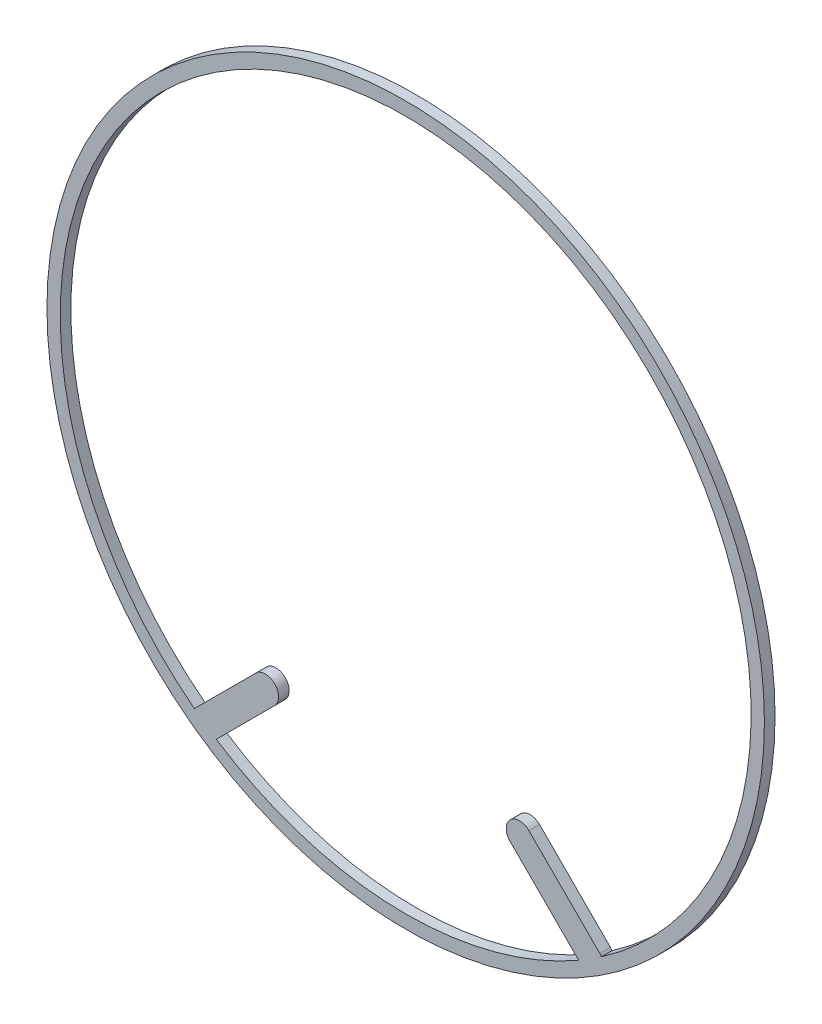
ISO-10303-21;
HEADER;
FILE_DESCRIPTION(('STEP AP214'),'2;1');
FILE_NAME('part.step','',(''),(''),'','','');
FILE_SCHEMA(('AUTOMOTIVE_DESIGN { 1 0 10303 214 1 1 1 1 }'));
ENDSEC;
DATA;
#1=APPLICATION_CONTEXT('core data for automotive mechanical design processes');
#2=APPLICATION_PROTOCOL_DEFINITION('international standard','automotive_design',2000,#1);
#3=PRODUCT_CONTEXT('',#1,'mechanical');
#4=PRODUCT('Part','Part','',(#3));
#5=PRODUCT_RELATED_PRODUCT_CATEGORY('part','',(#4));
#6=PRODUCT_DEFINITION_FORMATION('','',#4);
#7=PRODUCT_DEFINITION_CONTEXT('part definition',#1,'design');
#8=PRODUCT_DEFINITION('design','',#6,#7);
#9=PRODUCT_DEFINITION_SHAPE('','',#8);
#10=(LENGTH_UNIT() NAMED_UNIT(*) SI_UNIT(.MILLI.,.METRE.));
#11=(NAMED_UNIT(*) PLANE_ANGLE_UNIT() SI_UNIT($,.RADIAN.));
#12=(NAMED_UNIT(*) SI_UNIT($,.STERADIAN.) SOLID_ANGLE_UNIT());
#13=UNCERTAINTY_MEASURE_WITH_UNIT(LENGTH_MEASURE(1.E-05),#10,'distance_accuracy_value','');
#14=(GEOMETRIC_REPRESENTATION_CONTEXT(3) GLOBAL_UNCERTAINTY_ASSIGNED_CONTEXT((#13)) GLOBAL_UNIT_ASSIGNED_CONTEXT((#10,
#11,#12)) REPRESENTATION_CONTEXT('',''));
#15=CARTESIAN_POINT('',(0.,0.,0.));
#16=DIRECTION('',(0.,0.,1.));
#17=DIRECTION('',(1.,0.,0.));
#18=AXIS2_PLACEMENT_3D('',#15,#16,#17);
#19=CARTESIAN_POINT('',(0.,0.,2.54));
#20=DIRECTION('',(0.,0.,-1.));
#21=DIRECTION('',(-1.,0.,0.));
#22=AXIS2_PLACEMENT_3D('',#19,#20,#21);
#23=CYLINDRICAL_SURFACE('',#22,82.55);
#24=CARTESIAN_POINT('',(0.,0.,0.));
#25=DIRECTION('',(0.,0.,1.));
#26=DIRECTION('',(1.,0.,0.));
#27=AXIS2_PLACEMENT_3D('',#24,#25,#26);
#28=CIRCLE('',#27,82.55);
#29=CARTESIAN_POINT('',(46.7853456927431,-68.0120131183494,0.));
#30=VERTEX_POINT('',#29);
#31=CARTESIAN_POINT('',(-50.4766048244375,-65.319329952148,0.));
#32=VERTEX_POINT('',#31);
#33=EDGE_CURVE('E164',#30,#32,#28,.T.);
#34=ORIENTED_EDGE('',*,*,#33,.F.);
#35=DIRECTION('',(0.,0.,-1.));
#36=VECTOR('',#35,1.);
#37=CARTESIAN_POINT('',(46.7853456927431,-68.0120131183494,2.54));
#38=LINE('',#37,#36);
#39=CARTESIAN_POINT('',(46.7853456927431,-68.0120131183494,2.54));
#40=VERTEX_POINT('',#39);
#41=EDGE_CURVE('E11',#40,#30,#38,.T.);
#42=ORIENTED_EDGE('',*,*,#41,.F.);
#43=CARTESIAN_POINT('',(0.,0.,2.54));
#44=DIRECTION('',(0.,0.,1.));
#45=DIRECTION('',(1.,0.,0.));
#46=AXIS2_PLACEMENT_3D('',#43,#44,#45);
#47=CIRCLE('',#46,82.55);
#48=CARTESIAN_POINT('',(-50.4766048244375,-65.319329952148,2.54));
#49=VERTEX_POINT('',#48);
#50=EDGE_CURVE('E340',#40,#49,#47,.T.);
#51=ORIENTED_EDGE('',*,*,#50,.T.);
#52=DIRECTION('',(0.,0.,-1.));
#53=VECTOR('',#52,1.);
#54=CARTESIAN_POINT('',(-50.4766048244375,-65.319329952148,2.54));
#55=LINE('',#54,#53);
#56=EDGE_CURVE('E50',#49,#32,#55,.T.);
#57=ORIENTED_EDGE('',*,*,#56,.T.);
#58=EDGE_LOOP('',(#34,#42,#51,#57));
#59=FACE_BOUND('',#58,.T.);
#60=ADVANCED_FACE('F33',(#59),#23,.F.);
#61=CARTESIAN_POINT('',(44.1353782328995,-69.7608119809317,2.54));
#62=DIRECTION('',(0.,0.,-1.));
#63=DIRECTION('',(-1.,0.,0.));
#64=AXIS2_PLACEMENT_3D('',#61,#62,#63);
#65=CYLINDRICAL_SURFACE('',#64,3.175);
#66=CARTESIAN_POINT('',(44.1353782328995,-69.7608119809317,0.));
#67=DIRECTION('',(0.,0.,1.));
#68=DIRECTION('',(1.,0.,0.));
#69=AXIS2_PLACEMENT_3D('',#66,#67,#68);
#70=CIRCLE('',#69,3.175);
#71=CARTESIAN_POINT('',(46.3804422631666,-67.5157479506646,0.));
#72=VERTEX_POINT('',#71);
#73=EDGE_CURVE('E161',#72,#30,#70,.F.);
#74=ORIENTED_EDGE('',*,*,#73,.F.);
#75=DIRECTION('',(0.,0.,-1.));
#76=VECTOR('',#75,1.);
#77=CARTESIAN_POINT('',(46.3804422631666,-67.5157479506646,2.54));
#78=LINE('',#77,#76);
#79=CARTESIAN_POINT('',(46.3804422631666,-67.5157479506646,2.54));
#80=VERTEX_POINT('',#79);
#81=EDGE_CURVE('E42',#80,#72,#78,.T.);
#82=ORIENTED_EDGE('',*,*,#81,.F.);
#83=CARTESIAN_POINT('',(44.1353782328995,-69.7608119809317,2.54));
#84=DIRECTION('',(0.,0.,1.));
#85=DIRECTION('',(1.,0.,0.));
#86=AXIS2_PLACEMENT_3D('',#83,#84,#85);
#87=CIRCLE('',#86,3.175);
#88=EDGE_CURVE('E338',#80,#40,#87,.F.);
#89=ORIENTED_EDGE('',*,*,#88,.T.);
#90=ORIENTED_EDGE('',*,*,#41,.T.);
#91=EDGE_LOOP('',(#74,#82,#89,#90));
#92=FACE_BOUND('',#91,.T.);
#93=ADVANCED_FACE('F162',(#92),#65,.T.);
#94=CARTESIAN_POINT('',(83.8005578343696,-104.935863521868,2.54));
#95=DIRECTION('',(0.707106781186547,0.707106781186548,0.));
#96=DIRECTION('',(-0.707106781186548,0.707106781186547,0.));
#97=AXIS2_PLACEMENT_3D('',#94,#95,#96);
#98=PLANE('',#97);
#99=DIRECTION('',(0.707106781186548,-0.707106781186547,0.));
#100=VECTOR('',#99,1.);
#101=CARTESIAN_POINT('',(83.8005578343696,-104.935863521868,0.));
#102=LINE('',#101,#100);
#103=CARTESIAN_POINT('',(29.4516302822347,-50.5869359697327,0.));
#104=VERTEX_POINT('',#103);
#105=EDGE_CURVE('E154',#104,#72,#102,.T.);
#106=ORIENTED_EDGE('',*,*,#105,.F.);
#107=DIRECTION('',(0.,0.,-1.));
#108=VECTOR('',#107,1.);
#109=CARTESIAN_POINT('',(29.4516302822347,-50.5869359697327,2.54));
#110=LINE('',#109,#108);
#111=CARTESIAN_POINT('',(29.4516302822347,-50.5869359697327,2.54));
#112=VERTEX_POINT('',#111);
#113=EDGE_CURVE('E147',#112,#104,#110,.T.);
#114=ORIENTED_EDGE('',*,*,#113,.F.);
#115=DIRECTION('',(0.707106781186548,-0.707106781186547,0.));
#116=VECTOR('',#115,1.);
#117=CARTESIAN_POINT('',(83.8005578343696,-104.935863521868,2.54));
#118=LINE('',#117,#116);
#119=EDGE_CURVE('E156',#112,#80,#118,.T.);
#120=ORIENTED_EDGE('',*,*,#119,.T.);
#121=ORIENTED_EDGE('',*,*,#81,.T.);
#122=EDGE_LOOP('',(#106,#114,#120,#121));
#123=FACE_BOUND('',#122,.T.);
#124=ADVANCED_FACE('F152',(#123),#98,.T.);
#125=CARTESIAN_POINT('',(27.2065662519674,-52.832,2.54));
#126=DIRECTION('',(0.,0.,-1.));
#127=DIRECTION('',(-1.,0.,0.));
#128=AXIS2_PLACEMENT_3D('',#125,#126,#127);
#129=CYLINDRICAL_SURFACE('',#128,3.175);
#130=CARTESIAN_POINT('',(27.2065662519674,-52.832,0.));
#131=DIRECTION('',(0.,0.,1.));
#132=DIRECTION('',(1.,0.,0.));
#133=AXIS2_PLACEMENT_3D('',#130,#131,#132);
#134=CIRCLE('',#133,3.175);
#135=CARTESIAN_POINT('',(24.9615022217001,-55.0770640302673,0.));
#136=VERTEX_POINT('',#135);
#137=EDGE_CURVE('E169',#104,#136,#134,.T.);
#138=ORIENTED_EDGE('',*,*,#137,.T.);
#139=DIRECTION('',(0.,0.,-1.));
#140=VECTOR('',#139,1.);
#141=CARTESIAN_POINT('',(24.9615022217001,-55.0770640302673,2.54));
#142=LINE('',#141,#140);
#143=CARTESIAN_POINT('',(24.9615022217001,-55.0770640302673,2.54));
#144=VERTEX_POINT('',#143);
#145=EDGE_CURVE('E144',#144,#136,#142,.T.);
#146=ORIENTED_EDGE('',*,*,#145,.F.);
#147=CARTESIAN_POINT('',(27.2065662519674,-52.832,2.54));
#148=DIRECTION('',(0.,0.,1.));
#149=DIRECTION('',(1.,0.,0.));
#150=AXIS2_PLACEMENT_3D('',#147,#148,#149);
#151=CIRCLE('',#150,3.175);
#152=EDGE_CURVE('E336',#112,#144,#151,.T.);
#153=ORIENTED_EDGE('',*,*,#152,.F.);
#154=ORIENTED_EDGE('',*,*,#113,.T.);
#155=EDGE_LOOP('',(#138,#146,#153,#154));
#156=FACE_BOUND('',#155,.T.);
#157=ADVANCED_FACE('F213',(#156),#129,.T.);
#158=CARTESIAN_POINT('',(79.310429773835,-109.425991582402,2.54));
#159=DIRECTION('',(0.707106781186548,0.707106781186548,0.));
#160=DIRECTION('',(-0.707106781186548,0.707106781186548,0.));
#161=AXIS2_PLACEMENT_3D('',#158,#159,#160);
#162=PLANE('',#161);
#163=DIRECTION('',(0.707106781186548,-0.707106781186548,0.));
#164=VECTOR('',#163,1.);
#165=CARTESIAN_POINT('',(79.310429773835,-109.425991582402,0.));
#166=LINE('',#165,#164);
#167=CARTESIAN_POINT('',(41.3382693496002,-71.4538311581674,0.));
#168=VERTEX_POINT('',#167);
#169=EDGE_CURVE('E171',#136,#168,#166,.T.);
#170=ORIENTED_EDGE('',*,*,#169,.T.);
#171=DIRECTION('',(0.,0.,-1.));
#172=VECTOR('',#171,1.);
#173=CARTESIAN_POINT('',(41.3382693496002,-71.4538311581674,2.54));
#174=LINE('',#173,#172);
#175=CARTESIAN_POINT('',(41.3382693496002,-71.4538311581674,2.54));
#176=VERTEX_POINT('',#175);
#177=EDGE_CURVE('E142',#176,#168,#174,.T.);
#178=ORIENTED_EDGE('',*,*,#177,.F.);
#179=DIRECTION('',(0.707106781186548,-0.707106781186548,0.));
#180=VECTOR('',#179,1.);
#181=CARTESIAN_POINT('',(79.310429773835,-109.425991582402,2.54));
#182=LINE('',#181,#180);
#183=EDGE_CURVE('E333',#144,#176,#182,.T.);
#184=ORIENTED_EDGE('',*,*,#183,.F.);
#185=ORIENTED_EDGE('',*,*,#145,.T.);
#186=EDGE_LOOP('',(#170,#178,#184,#185));
#187=FACE_BOUND('',#186,.T.);
#188=ADVANCED_FACE('F216',(#187),#162,.F.);
#189=CARTESIAN_POINT('',(0.,0.,2.54));
#190=DIRECTION('',(0.,0.,-1.));
#191=DIRECTION('',(-1.,0.,0.));
#192=AXIS2_PLACEMENT_3D('',#189,#190,#191);
#193=CYLINDRICAL_SURFACE('',#192,82.55);
#194=CARTESIAN_POINT('',(0.,0.,0.));
#195=DIRECTION('',(0.,0.,1.));
#196=DIRECTION('',(1.,0.,0.));
#197=AXIS2_PLACEMENT_3D('',#194,#195,#196);
#198=CIRCLE('',#197,82.55);
#199=CARTESIAN_POINT('',(-45.2610474198302,-69.0357884467171,0.));
#200=VERTEX_POINT('',#199);
#201=EDGE_CURVE('E177',#200,#168,#198,.T.);
#202=ORIENTED_EDGE('',*,*,#201,.F.);
#203=DIRECTION('',(0.,0.,-1.));
#204=VECTOR('',#203,1.);
#205=CARTESIAN_POINT('',(-45.2610474198302,-69.0357884467171,2.54));
#206=LINE('',#205,#204);
#207=CARTESIAN_POINT('',(-45.2610474198302,-69.0357884467171,2.54));
#208=VERTEX_POINT('',#207);
#209=EDGE_CURVE('E136',#208,#200,#206,.T.);
#210=ORIENTED_EDGE('',*,*,#209,.F.);
#211=CARTESIAN_POINT('',(0.,0.,2.54));
#212=DIRECTION('',(0.,0.,1.));
#213=DIRECTION('',(1.,0.,0.));
#214=AXIS2_PLACEMENT_3D('',#211,#212,#213);
#215=CIRCLE('',#214,82.55);
#216=EDGE_CURVE('E331',#208,#176,#215,.T.);
#217=ORIENTED_EDGE('',*,*,#216,.T.);
#218=ORIENTED_EDGE('',*,*,#177,.T.);
#219=EDGE_LOOP('',(#202,#210,#217,#218));
#220=FACE_BOUND('',#219,.T.);
#221=ADVANCED_FACE('F220',(#220),#193,.F.);
#222=CARTESIAN_POINT('',(-82.4808401646752,-106.255581191562,2.54));
#223=DIRECTION('',(0.707106781186548,-0.707106781186548,0.));
#224=DIRECTION('',(0.707106781186548,0.707106781186548,0.));
#225=AXIS2_PLACEMENT_3D('',#222,#223,#224);
#226=PLANE('',#225);
#227=DIRECTION('',(-0.707106781186548,-0.707106781186548,0.));
#228=VECTOR('',#227,1.);
#229=CARTESIAN_POINT('',(-82.4808401646752,-106.255581191562,0.));
#230=LINE('',#229,#228);
#231=CARTESIAN_POINT('',(-31.3023230033804,-55.0770640302673,0.));
#232=VERTEX_POINT('',#231);
#233=EDGE_CURVE('E180',#232,#200,#230,.T.);
#234=ORIENTED_EDGE('',*,*,#233,.F.);
#235=DIRECTION('',(0.,0.,-1.));
#236=VECTOR('',#235,1.);
#237=CARTESIAN_POINT('',(-31.3023230033804,-55.0770640302673,2.54));
#238=LINE('',#237,#236);
#239=CARTESIAN_POINT('',(-31.3023230033804,-55.0770640302673,2.54));
#240=VERTEX_POINT('',#239);
#241=EDGE_CURVE('E134',#240,#232,#238,.T.);
#242=ORIENTED_EDGE('',*,*,#241,.F.);
#243=DIRECTION('',(-0.707106781186548,-0.707106781186548,0.));
#244=VECTOR('',#243,1.);
#245=CARTESIAN_POINT('',(-82.4808401646752,-106.255581191562,2.54));
#246=LINE('',#245,#244);
#247=EDGE_CURVE('E128',#240,#208,#246,.T.);
#248=ORIENTED_EDGE('',*,*,#247,.T.);
#249=ORIENTED_EDGE('',*,*,#209,.T.);
#250=EDGE_LOOP('',(#234,#242,#248,#249));
#251=FACE_BOUND('',#250,.T.);
#252=ADVANCED_FACE('F224',(#251),#226,.T.);
#253=CARTESIAN_POINT('',(-33.5473870336477,-52.832,2.54));
#254=DIRECTION('',(0.,0.,-1.));
#255=DIRECTION('',(-1.,0.,0.));
#256=AXIS2_PLACEMENT_3D('',#253,#254,#255);
#257=CYLINDRICAL_SURFACE('',#256,3.175);
#258=CARTESIAN_POINT('',(-33.5473870336477,-52.832,0.));
#259=DIRECTION('',(0.,0.,1.));
#260=DIRECTION('',(1.,0.,0.));
#261=AXIS2_PLACEMENT_3D('',#258,#259,#260);
#262=CIRCLE('',#261,3.175);
#263=CARTESIAN_POINT('',(-35.792451063915,-50.5869359697327,0.));
#264=VERTEX_POINT('',#263);
#265=EDGE_CURVE('E133',#232,#264,#262,.T.);
#266=ORIENTED_EDGE('',*,*,#265,.T.);
#267=DIRECTION('',(0.,0.,-1.));
#268=VECTOR('',#267,1.);
#269=CARTESIAN_POINT('',(-35.792451063915,-50.5869359697327,2.54));
#270=LINE('',#269,#268);
#271=CARTESIAN_POINT('',(-35.792451063915,-50.5869359697327,2.54));
#272=VERTEX_POINT('',#271);
#273=EDGE_CURVE('E116',#272,#264,#270,.T.);
#274=ORIENTED_EDGE('',*,*,#273,.F.);
#275=CARTESIAN_POINT('',(-33.5473870336477,-52.832,2.54));
#276=DIRECTION('',(0.,0.,1.));
#277=DIRECTION('',(1.,0.,0.));
#278=AXIS2_PLACEMENT_3D('',#275,#276,#277);
#279=CIRCLE('',#278,3.175);
#280=EDGE_CURVE('E121',#240,#272,#279,.T.);
#281=ORIENTED_EDGE('',*,*,#280,.F.);
#282=ORIENTED_EDGE('',*,*,#241,.T.);
#283=EDGE_LOOP('',(#266,#274,#281,#282));
#284=FACE_BOUND('',#283,.T.);
#285=ADVANCED_FACE('F131',(#284),#257,.T.);
#286=CARTESIAN_POINT('',(-86.9709682252097,-101.765453131027,2.54));
#287=DIRECTION('',(0.707106781186547,-0.707106781186548,0.));
#288=DIRECTION('',(0.707106781186548,0.707106781186547,0.));
#289=AXIS2_PLACEMENT_3D('',#286,#287,#288);
#290=PLANE('',#289);
#291=DIRECTION('',(-0.707106781186548,-0.707106781186547,0.));
#292=VECTOR('',#291,1.);
#293=CARTESIAN_POINT('',(-86.9709682252097,-101.765453131027,0.));
#294=LINE('',#293,#292);
#295=CARTESIAN_POINT('',(-50.1725167587163,-64.967001664534,0.));
#296=VERTEX_POINT('',#295);
#297=EDGE_CURVE('E184',#264,#296,#294,.T.);
#298=ORIENTED_EDGE('',*,*,#297,.T.);
#299=DIRECTION('',(0.,0.,-1.));
#300=VECTOR('',#299,1.);
#301=CARTESIAN_POINT('',(-50.1725167587163,-64.967001664534,2.54));
#302=LINE('',#301,#300);
#303=CARTESIAN_POINT('',(-50.1725167587163,-64.967001664534,2.54));
#304=VERTEX_POINT('',#303);
#305=EDGE_CURVE('E82',#304,#296,#302,.T.);
#306=ORIENTED_EDGE('',*,*,#305,.F.);
#307=DIRECTION('',(-0.707106781186548,-0.707106781186547,0.));
#308=VECTOR('',#307,1.);
#309=CARTESIAN_POINT('',(-86.9709682252097,-101.765453131027,2.54));
#310=LINE('',#309,#308);
#311=EDGE_CURVE('E112',#272,#304,#310,.T.);
#312=ORIENTED_EDGE('',*,*,#311,.F.);
#313=ORIENTED_EDGE('',*,*,#273,.T.);
#314=EDGE_LOOP('',(#298,#306,#312,#313));
#315=FACE_BOUND('',#314,.T.);
#316=ADVANCED_FACE('F114',(#315),#290,.F.);
#317=CARTESIAN_POINT('',(0.,0.,2.54));
#318=DIRECTION('',(0.,0.,-1.));
#319=DIRECTION('',(-1.,0.,0.));
#320=AXIS2_PLACEMENT_3D('',#317,#318,#319);
#321=CYLINDRICAL_SURFACE('',#320,85.725);
#322=CARTESIAN_POINT('',(0.,0.,2.54));
#323=DIRECTION('',(0.,0.,1.));
#324=DIRECTION('',(1.,0.,0.));
#325=AXIS2_PLACEMENT_3D('',#322,#323,#324);
#326=CIRCLE('',#325,85.725);
#327=CARTESIAN_POINT('',(85.725,0.,2.54));
#328=VERTEX_POINT('',#327);
#329=EDGE_CURVE('E188',#328,#328,#326,.T.);
#330=ORIENTED_EDGE('',*,*,#329,.F.);
#331=EDGE_LOOP('',(#330));
#332=FACE_BOUND('',#331,.T.);
#333=CARTESIAN_POINT('',(0.,0.,0.));
#334=DIRECTION('',(0.,0.,1.));
#335=DIRECTION('',(1.,0.,0.));
#336=AXIS2_PLACEMENT_3D('',#333,#334,#335);
#337=CIRCLE('',#336,85.725);
#338=CARTESIAN_POINT('',(85.725,0.,0.));
#339=VERTEX_POINT('',#338);
#340=EDGE_CURVE('E191',#339,#339,#337,.T.);
#341=ORIENTED_EDGE('',*,*,#340,.T.);
#342=EDGE_LOOP('',(#341));
#343=FACE_BOUND('',#342,.T.);
#344=ADVANCED_FACE('F35',(#332,#343),#321,.T.);
#345=CARTESIAN_POINT('',(-47.9274527284491,-67.2120656948012,2.54));
#346=DIRECTION('',(0.,0.,-1.));
#347=DIRECTION('',(-1.,0.,0.));
#348=AXIS2_PLACEMENT_3D('',#345,#346,#347);
#349=CYLINDRICAL_SURFACE('',#348,3.175);
#350=CARTESIAN_POINT('',(-47.9274527284491,-67.2120656948012,0.));
#351=DIRECTION('',(0.,0.,1.));
#352=DIRECTION('',(1.,0.,0.));
#353=AXIS2_PLACEMENT_3D('',#350,#351,#352);
#354=CIRCLE('',#353,3.175);
#355=EDGE_CURVE('E186',#32,#296,#354,.F.);
#356=ORIENTED_EDGE('',*,*,#355,.F.);
#357=ORIENTED_EDGE('',*,*,#56,.F.);
#358=CARTESIAN_POINT('',(-47.9274527284491,-67.2120656948012,2.54));
#359=DIRECTION('',(0.,0.,1.));
#360=DIRECTION('',(1.,0.,0.));
#361=AXIS2_PLACEMENT_3D('',#358,#359,#360);
#362=CIRCLE('',#361,3.175);
#363=EDGE_CURVE('E120',#49,#304,#362,.F.);
#364=ORIENTED_EDGE('',*,*,#363,.T.);
#365=ORIENTED_EDGE('',*,*,#305,.T.);
#366=EDGE_LOOP('',(#356,#357,#364,#365));
#367=FACE_BOUND('',#366,.T.);
#368=ADVANCED_FACE('F193',(#367),#349,.T.);
#369=CARTESIAN_POINT('',(0.,-188.736421356237,2.54));
#370=DIRECTION('',(0.,0.,1.));
#371=DIRECTION('',(1.,0.,0.));
#372=AXIS2_PLACEMENT_3D('',#369,#370,#371);
#373=PLANE('',#372);
#374=ORIENTED_EDGE('',*,*,#329,.T.);
#375=EDGE_LOOP('',(#374));
#376=FACE_BOUND('',#375,.T.);
#377=ORIENTED_EDGE('',*,*,#50,.F.);
#378=ORIENTED_EDGE('',*,*,#88,.F.);
#379=ORIENTED_EDGE('',*,*,#119,.F.);
#380=ORIENTED_EDGE('',*,*,#152,.T.);
#381=ORIENTED_EDGE('',*,*,#183,.T.);
#382=ORIENTED_EDGE('',*,*,#216,.F.);
#383=ORIENTED_EDGE('',*,*,#247,.F.);
#384=ORIENTED_EDGE('',*,*,#280,.T.);
#385=ORIENTED_EDGE('',*,*,#311,.T.);
#386=ORIENTED_EDGE('',*,*,#363,.F.);
#387=EDGE_LOOP('',(#377,#378,#379,#380,#381,#382,#383,#384,#385,#386));
#388=FACE_BOUND('',#387,.T.);
#389=ADVANCED_FACE('F125',(#376,#388),#373,.T.);
#390=CARTESIAN_POINT('',(0.,-188.736421356237,0.));
#391=DIRECTION('',(0.,0.,1.));
#392=DIRECTION('',(1.,0.,0.));
#393=AXIS2_PLACEMENT_3D('',#390,#391,#392);
#394=PLANE('',#393);
#395=ORIENTED_EDGE('',*,*,#340,.F.);
#396=EDGE_LOOP('',(#395));
#397=FACE_BOUND('',#396,.T.);
#398=ORIENTED_EDGE('',*,*,#33,.T.);
#399=ORIENTED_EDGE('',*,*,#355,.T.);
#400=ORIENTED_EDGE('',*,*,#297,.F.);
#401=ORIENTED_EDGE('',*,*,#265,.F.);
#402=ORIENTED_EDGE('',*,*,#233,.T.);
#403=ORIENTED_EDGE('',*,*,#201,.T.);
#404=ORIENTED_EDGE('',*,*,#169,.F.);
#405=ORIENTED_EDGE('',*,*,#137,.F.);
#406=ORIENTED_EDGE('',*,*,#105,.T.);
#407=ORIENTED_EDGE('',*,*,#73,.T.);
#408=EDGE_LOOP('',(#398,#399,#400,#401,#402,#403,#404,#405,#406,#407));
#409=FACE_BOUND('',#408,.T.);
#410=ADVANCED_FACE('F167',(#397,#409),#394,.F.);
#411=CLOSED_SHELL('',(#60,#93,#124,#157,#188,#221,#252,#285,#316,#344,#368,#389,#410));
#412=MANIFOLD_SOLID_BREP('B2',#411);
#413=ADVANCED_BREP_SHAPE_REPRESENTATION('',(#18,#412),#14);
#414=SHAPE_DEFINITION_REPRESENTATION(#9,#413);
ENDSEC;
END-ISO-10303-21;
